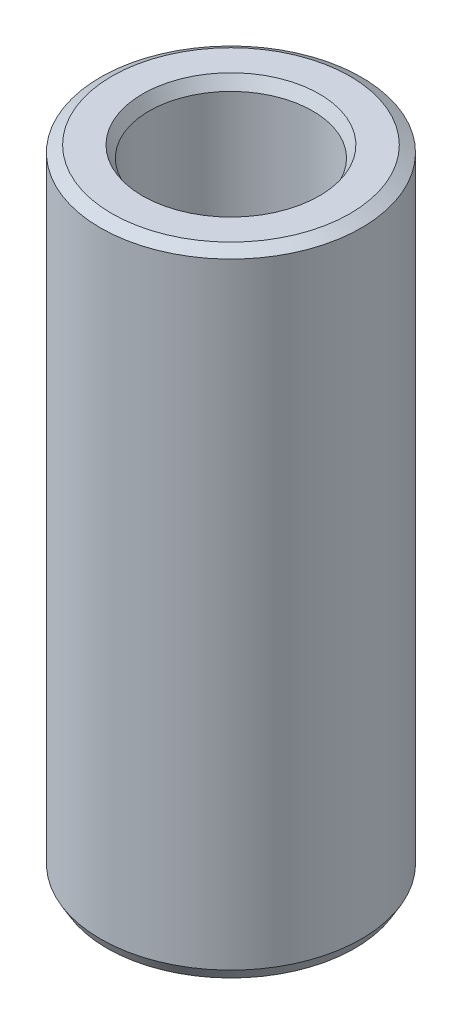
ISO-10303-21;
HEADER;
FILE_DESCRIPTION(('STEP AP214'),'2;1');
FILE_NAME('part.step','',(''),(''),'','','');
FILE_SCHEMA(('AUTOMOTIVE_DESIGN { 1 0 10303 214 1 1 1 1 }'));
ENDSEC;
DATA;
#1=APPLICATION_CONTEXT('core data for automotive mechanical design processes');
#2=APPLICATION_PROTOCOL_DEFINITION('international standard','automotive_design',2000,#1);
#3=PRODUCT_CONTEXT('',#1,'mechanical');
#4=PRODUCT('Part','Part','',(#3));
#5=PRODUCT_RELATED_PRODUCT_CATEGORY('part','',(#4));
#6=PRODUCT_DEFINITION_FORMATION('','',#4);
#7=PRODUCT_DEFINITION_CONTEXT('part definition',#1,'design');
#8=PRODUCT_DEFINITION('design','',#6,#7);
#9=PRODUCT_DEFINITION_SHAPE('','',#8);
#10=(LENGTH_UNIT() NAMED_UNIT(*) SI_UNIT(.MILLI.,.METRE.));
#11=(NAMED_UNIT(*) PLANE_ANGLE_UNIT() SI_UNIT($,.RADIAN.));
#12=(NAMED_UNIT(*) SI_UNIT($,.STERADIAN.) SOLID_ANGLE_UNIT());
#13=UNCERTAINTY_MEASURE_WITH_UNIT(LENGTH_MEASURE(1.E-05),#10,'distance_accuracy_value','');
#14=(GEOMETRIC_REPRESENTATION_CONTEXT(3) GLOBAL_UNCERTAINTY_ASSIGNED_CONTEXT((#13)) GLOBAL_UNIT_ASSIGNED_CONTEXT((#10,
#11,#12)) REPRESENTATION_CONTEXT('',''));
#15=CARTESIAN_POINT('',(0.,0.,0.));
#16=DIRECTION('',(0.,0.,1.));
#17=DIRECTION('',(1.,0.,0.));
#18=AXIS2_PLACEMENT_3D('',#15,#16,#17);
#19=CARTESIAN_POINT('',(0.,133.564013848493,0.));
#20=DIRECTION('',(0.,-1.,0.));
#21=DIRECTION('',(0.,0.,-1.));
#22=AXIS2_PLACEMENT_3D('',#19,#20,#21);
#23=CYLINDRICAL_SURFACE('',#22,27.5);
#24=CARTESIAN_POINT('',(0.,2.4138411049989,0.));
#25=DIRECTION('',(0.,1.,0.));
#26=DIRECTION('',(0.,0.,1.));
#27=AXIS2_PLACEMENT_3D('',#24,#25,#26);
#28=CIRCLE('',#27,27.5);
#29=CARTESIAN_POINT('',(0.,2.4138411049989,27.5));
#30=VERTEX_POINT('',#29);
#31=EDGE_CURVE('E10',#30,#30,#28,.T.);
#32=ORIENTED_EDGE('',*,*,#31,.T.);
#33=EDGE_LOOP('',(#32));
#34=FACE_BOUND('',#33,.T.);
#35=CARTESIAN_POINT('',(0.,132.170382036741,0.));
#36=DIRECTION('',(0.,1.,0.));
#37=DIRECTION('',(0.,0.,1.));
#38=AXIS2_PLACEMENT_3D('',#35,#36,#37);
#39=CIRCLE('',#38,27.5);
#40=CARTESIAN_POINT('',(0.,132.170382036741,27.5));
#41=VERTEX_POINT('',#40);
#42=EDGE_CURVE('E50',#41,#41,#39,.F.);
#43=ORIENTED_EDGE('',*,*,#42,.T.);
#44=EDGE_LOOP('',(#43));
#45=FACE_BOUND('',#44,.T.);
#46=ADVANCED_FACE('F39',(#34,#45),#23,.T.);
#47=CARTESIAN_POINT('',(0.,133.564013848493,0.));
#48=DIRECTION('',(0.,1.,0.));
#49=DIRECTION('',(0.,0.,1.));
#50=AXIS2_PLACEMENT_3D('',#47,#48,#49);
#51=PLANE('',#50);
#52=CARTESIAN_POINT('',(0.,133.564013848493,0.));
#53=DIRECTION('',(0.,1.,0.));
#54=DIRECTION('',(0.,0.,1.));
#55=AXIS2_PLACEMENT_3D('',#52,#53,#54);
#56=CIRCLE('',#55,18.625983094503);
#57=CARTESIAN_POINT('',(0.,133.564013848493,18.625983094503));
#58=VERTEX_POINT('',#57);
#59=EDGE_CURVE('E58',#58,#58,#56,.F.);
#60=ORIENTED_EDGE('',*,*,#59,.T.);
#61=EDGE_LOOP('',(#60));
#62=FACE_BOUND('',#61,.T.);
#63=CARTESIAN_POINT('',(0.,133.564013848493,0.));
#64=DIRECTION('',(0.,1.,0.));
#65=DIRECTION('',(0.,0.,1.));
#66=AXIS2_PLACEMENT_3D('',#63,#64,#65);
#67=CIRCLE('',#66,25.0861588950011);
#68=CARTESIAN_POINT('',(0.,133.564013848493,25.0861588950011));
#69=VERTEX_POINT('',#68);
#70=EDGE_CURVE('E61',#69,#69,#67,.T.);
#71=ORIENTED_EDGE('',*,*,#70,.T.);
#72=EDGE_LOOP('',(#71));
#73=FACE_BOUND('',#72,.T.);
#74=ADVANCED_FACE('F88',(#62,#73),#51,.T.);
#75=CARTESIAN_POINT('',(0.,0.,0.));
#76=DIRECTION('',(0.,1.,0.));
#77=DIRECTION('',(0.,0.,1.));
#78=AXIS2_PLACEMENT_3D('',#75,#76,#77);
#79=PLANE('',#78);
#80=CARTESIAN_POINT('',(0.,0.,0.));
#81=DIRECTION('',(0.,1.,0.));
#82=DIRECTION('',(0.,0.,1.));
#83=AXIS2_PLACEMENT_3D('',#80,#81,#82);
#84=CIRCLE('',#83,19.6461923877498);
#85=CARTESIAN_POINT('',(0.,0.,19.6461923877498));
#86=VERTEX_POINT('',#85);
#87=EDGE_CURVE('E51',#86,#86,#84,.T.);
#88=ORIENTED_EDGE('',*,*,#87,.T.);
#89=EDGE_LOOP('',(#88));
#90=FACE_BOUND('',#89,.T.);
#91=CARTESIAN_POINT('',(0.,0.,0.));
#92=DIRECTION('',(0.,1.,0.));
#93=DIRECTION('',(0.,0.,1.));
#94=AXIS2_PLACEMENT_3D('',#91,#92,#93);
#95=CIRCLE('',#94,26.1063681882479);
#96=CARTESIAN_POINT('',(0.,0.,26.1063681882479));
#97=VERTEX_POINT('',#96);
#98=EDGE_CURVE('E54',#97,#97,#95,.F.);
#99=ORIENTED_EDGE('',*,*,#98,.T.);
#100=EDGE_LOOP('',(#99));
#101=FACE_BOUND('',#100,.T.);
#102=ADVANCED_FACE('F83',(#90,#101),#79,.F.);
#103=CARTESIAN_POINT('',(0.,133.564013848493,0.));
#104=DIRECTION('',(0.,-1.,0.));
#105=DIRECTION('',(0.,0.,-1.));
#106=AXIS2_PLACEMENT_3D('',#103,#104,#105);
#107=CYLINDRICAL_SURFACE('',#106,17.2323512827509);
#108=CARTESIAN_POINT('',(0.,131.150172743494,0.));
#109=DIRECTION('',(0.,1.,0.));
#110=DIRECTION('',(0.,0.,1.));
#111=AXIS2_PLACEMENT_3D('',#108,#109,#110);
#112=CIRCLE('',#111,17.2323512827509);
#113=CARTESIAN_POINT('',(0.,131.150172743494,17.2323512827509));
#114=VERTEX_POINT('',#113);
#115=EDGE_CURVE('E67',#114,#114,#112,.T.);
#116=ORIENTED_EDGE('',*,*,#115,.T.);
#117=EDGE_LOOP('',(#116));
#118=FACE_BOUND('',#117,.T.);
#119=CARTESIAN_POINT('',(0.,1.39363181175212,0.));
#120=DIRECTION('',(0.,1.,0.));
#121=DIRECTION('',(0.,0.,1.));
#122=AXIS2_PLACEMENT_3D('',#119,#120,#121);
#123=CIRCLE('',#122,17.2323512827509);
#124=CARTESIAN_POINT('',(0.,1.39363181175212,17.2323512827509));
#125=VERTEX_POINT('',#124);
#126=EDGE_CURVE('E69',#125,#125,#123,.F.);
#127=ORIENTED_EDGE('',*,*,#126,.T.);
#128=EDGE_LOOP('',(#127));
#129=FACE_BOUND('',#128,.T.);
#130=ADVANCED_FACE('F71',(#118,#129),#107,.F.);
#131=CARTESIAN_POINT('',(0.,131.150172743494,0.));
#132=DIRECTION('',(0.,1.,0.));
#133=DIRECTION('',(0.,0.,1.));
#134=AXIS2_PLACEMENT_3D('',#131,#132,#133);
#135=CONICAL_SURFACE('',#134,17.2323512827509,0.523598775598305);
#136=ORIENTED_EDGE('',*,*,#59,.F.);
#137=EDGE_LOOP('',(#136));
#138=FACE_BOUND('',#137,.T.);
#139=ORIENTED_EDGE('',*,*,#115,.F.);
#140=EDGE_LOOP('',(#139));
#141=FACE_BOUND('',#140,.T.);
#142=ADVANCED_FACE('F77',(#138,#141),#135,.F.);
#143=CARTESIAN_POINT('',(0.,0.,0.));
#144=DIRECTION('',(0.,-1.,0.));
#145=DIRECTION('',(0.,0.,-1.));
#146=AXIS2_PLACEMENT_3D('',#143,#144,#145);
#147=CONICAL_SURFACE('',#146,19.6461923877498,1.0471975511966);
#148=ORIENTED_EDGE('',*,*,#126,.F.);
#149=EDGE_LOOP('',(#148));
#150=FACE_BOUND('',#149,.T.);
#151=ORIENTED_EDGE('',*,*,#87,.F.);
#152=EDGE_LOOP('',(#151));
#153=FACE_BOUND('',#152,.T.);
#154=ADVANCED_FACE('F73',(#150,#153),#147,.F.);
#155=CARTESIAN_POINT('',(0.,2.4138411049989,0.));
#156=DIRECTION('',(0.,1.,0.));
#157=DIRECTION('',(0.,0.,1.));
#158=AXIS2_PLACEMENT_3D('',#155,#156,#157);
#159=CONICAL_SURFACE('',#158,27.5,0.523598775598301);
#160=ORIENTED_EDGE('',*,*,#98,.F.);
#161=EDGE_LOOP('',(#160));
#162=FACE_BOUND('',#161,.T.);
#163=ORIENTED_EDGE('',*,*,#31,.F.);
#164=EDGE_LOOP('',(#163));
#165=FACE_BOUND('',#164,.T.);
#166=ADVANCED_FACE('F76',(#162,#165),#159,.T.);
#167=CARTESIAN_POINT('',(0.,133.564013848493,0.));
#168=DIRECTION('',(0.,-1.,0.));
#169=DIRECTION('',(0.,0.,-1.));
#170=AXIS2_PLACEMENT_3D('',#167,#168,#169);
#171=CONICAL_SURFACE('',#170,25.0861588950011,1.0471975511966);
#172=ORIENTED_EDGE('',*,*,#42,.F.);
#173=EDGE_LOOP('',(#172));
#174=FACE_BOUND('',#173,.T.);
#175=ORIENTED_EDGE('',*,*,#70,.F.);
#176=EDGE_LOOP('',(#175));
#177=FACE_BOUND('',#176,.T.);
#178=ADVANCED_FACE('F45',(#174,#177),#171,.T.);
#179=CLOSED_SHELL('',(#46,#74,#102,#130,#142,#154,#166,#178));
#180=MANIFOLD_SOLID_BREP('B2',#179);
#181=ADVANCED_BREP_SHAPE_REPRESENTATION('',(#18,#180),#14);
#182=SHAPE_DEFINITION_REPRESENTATION(#9,#181);
ENDSEC;
END-ISO-10303-21;
